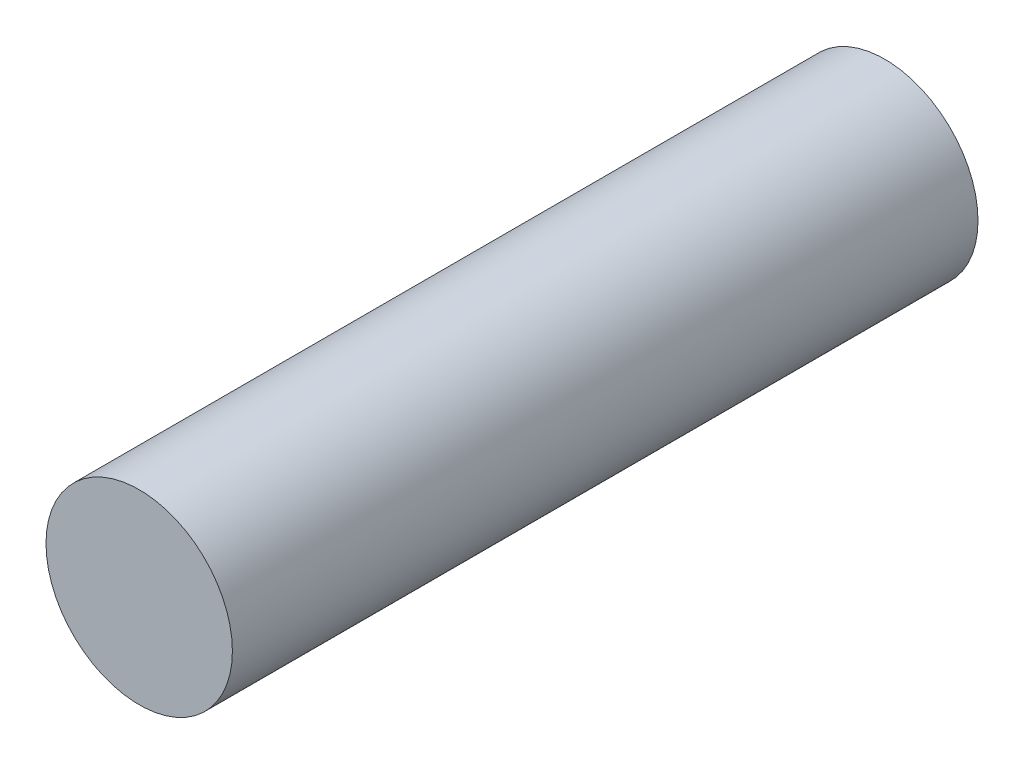
ISO-10303-21;
HEADER;
FILE_DESCRIPTION(('STEP AP214'),'2;1');
FILE_NAME('part.step','',(''),(''),'','','');
FILE_SCHEMA(('AUTOMOTIVE_DESIGN { 1 0 10303 214 1 1 1 1 }'));
ENDSEC;
DATA;
#1=APPLICATION_CONTEXT('core data for automotive mechanical design processes');
#2=APPLICATION_PROTOCOL_DEFINITION('international standard','automotive_design',2000,#1);
#3=PRODUCT_CONTEXT('',#1,'mechanical');
#4=PRODUCT('Part','Part','',(#3));
#5=PRODUCT_RELATED_PRODUCT_CATEGORY('part','',(#4));
#6=PRODUCT_DEFINITION_FORMATION('','',#4);
#7=PRODUCT_DEFINITION_CONTEXT('part definition',#1,'design');
#8=PRODUCT_DEFINITION('design','',#6,#7);
#9=PRODUCT_DEFINITION_SHAPE('','',#8);
#10=(LENGTH_UNIT() NAMED_UNIT(*) SI_UNIT(.MILLI.,.METRE.));
#11=(NAMED_UNIT(*) PLANE_ANGLE_UNIT() SI_UNIT($,.RADIAN.));
#12=(NAMED_UNIT(*) SI_UNIT($,.STERADIAN.) SOLID_ANGLE_UNIT());
#13=UNCERTAINTY_MEASURE_WITH_UNIT(LENGTH_MEASURE(1.E-05),#10,'distance_accuracy_value','');
#14=(GEOMETRIC_REPRESENTATION_CONTEXT(3) GLOBAL_UNCERTAINTY_ASSIGNED_CONTEXT((#13)) GLOBAL_UNIT_ASSIGNED_CONTEXT((#10,
#11,#12)) REPRESENTATION_CONTEXT('',''));
#15=CARTESIAN_POINT('',(0.,0.,0.));
#16=DIRECTION('',(0.,0.,1.));
#17=DIRECTION('',(1.,0.,0.));
#18=AXIS2_PLACEMENT_3D('',#15,#16,#17);
#19=CARTESIAN_POINT('',(0.,0.,38.1));
#20=DIRECTION('',(0.,0.,-1.));
#21=DIRECTION('',(-1.,0.,0.));
#22=AXIS2_PLACEMENT_3D('',#19,#20,#21);
#23=CYLINDRICAL_SURFACE('',#22,4.7625);
#24=CARTESIAN_POINT('',(0.,0.,38.1));
#25=DIRECTION('',(0.,0.,1.));
#26=DIRECTION('',(1.,0.,0.));
#27=AXIS2_PLACEMENT_3D('',#24,#25,#26);
#28=CIRCLE('',#27,4.7625);
#29=CARTESIAN_POINT('',(4.7625,0.,38.1));
#30=VERTEX_POINT('',#29);
#31=EDGE_CURVE('E10',#30,#30,#28,.T.);
#32=ORIENTED_EDGE('',*,*,#31,.F.);
#33=EDGE_LOOP('',(#32));
#34=FACE_BOUND('',#33,.T.);
#35=CARTESIAN_POINT('',(0.,0.,0.));
#36=DIRECTION('',(0.,0.,1.));
#37=DIRECTION('',(1.,0.,0.));
#38=AXIS2_PLACEMENT_3D('',#35,#36,#37);
#39=CIRCLE('',#38,4.7625);
#40=CARTESIAN_POINT('',(4.7625,0.,0.));
#41=VERTEX_POINT('',#40);
#42=EDGE_CURVE('E35',#41,#41,#39,.T.);
#43=ORIENTED_EDGE('',*,*,#42,.T.);
#44=EDGE_LOOP('',(#43));
#45=FACE_BOUND('',#44,.T.);
#46=ADVANCED_FACE('F29',(#34,#45),#23,.T.);
#47=CARTESIAN_POINT('',(0.,0.,38.1));
#48=DIRECTION('',(0.,0.,1.));
#49=DIRECTION('',(1.,0.,0.));
#50=AXIS2_PLACEMENT_3D('',#47,#48,#49);
#51=PLANE('',#50);
#52=ORIENTED_EDGE('',*,*,#31,.T.);
#53=EDGE_LOOP('',(#52));
#54=FACE_BOUND('',#53,.T.);
#55=ADVANCED_FACE('F44',(#54),#51,.T.);
#56=CARTESIAN_POINT('',(0.,0.,0.));
#57=DIRECTION('',(0.,0.,1.));
#58=DIRECTION('',(1.,0.,0.));
#59=AXIS2_PLACEMENT_3D('',#56,#57,#58);
#60=PLANE('',#59);
#61=ORIENTED_EDGE('',*,*,#42,.F.);
#62=EDGE_LOOP('',(#61));
#63=FACE_BOUND('',#62,.T.);
#64=ADVANCED_FACE('F42',(#63),#60,.F.);
#65=CLOSED_SHELL('',(#46,#55,#64));
#66=MANIFOLD_SOLID_BREP('B2',#65);
#67=ADVANCED_BREP_SHAPE_REPRESENTATION('',(#18,#66),#14);
#68=SHAPE_DEFINITION_REPRESENTATION(#9,#67);
ENDSEC;
END-ISO-10303-21;
